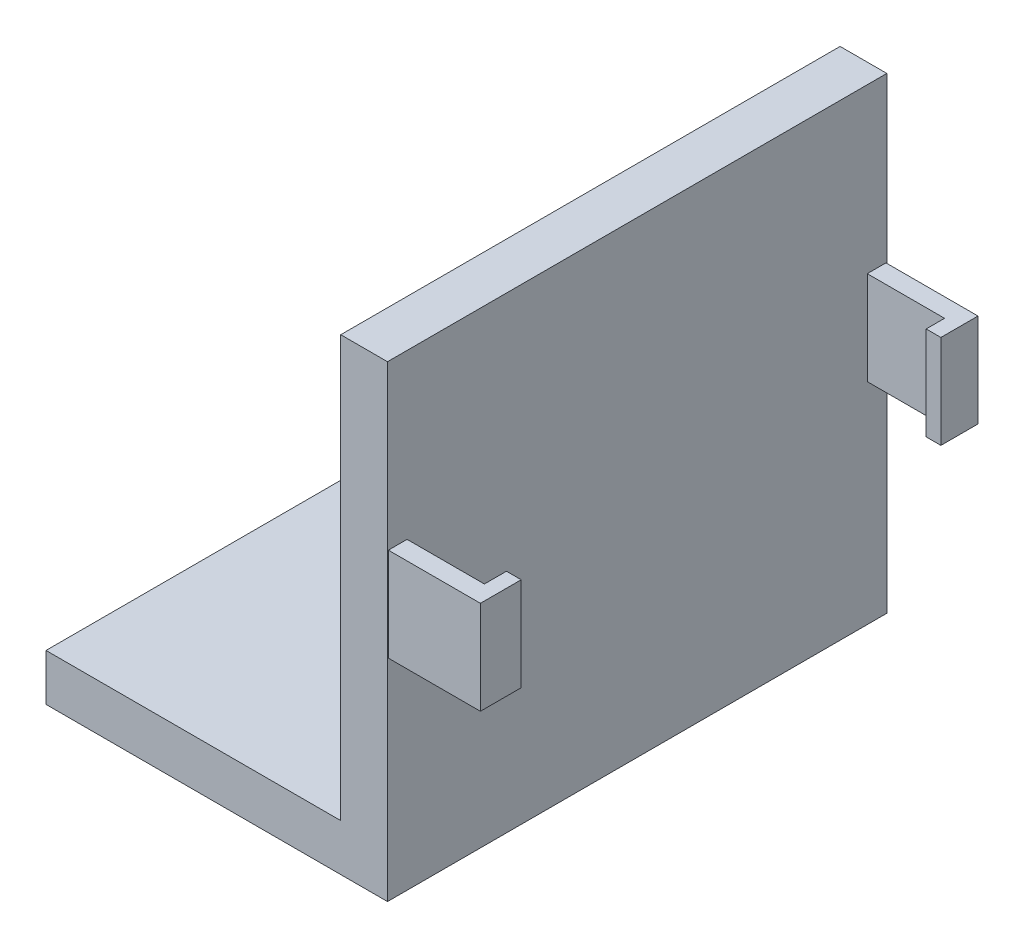
ISO-10303-21;
HEADER;
FILE_DESCRIPTION(('STEP AP214'),'2;1');
FILE_NAME('part.step','',(''),(''),'','','');
FILE_SCHEMA(('AUTOMOTIVE_DESIGN { 1 0 10303 214 1 1 1 1 }'));
ENDSEC;
DATA;
#1=APPLICATION_CONTEXT('core data for automotive mechanical design processes');
#2=APPLICATION_PROTOCOL_DEFINITION('international standard','automotive_design',2000,#1);
#3=PRODUCT_CONTEXT('',#1,'mechanical');
#4=PRODUCT('Part','Part','',(#3));
#5=PRODUCT_RELATED_PRODUCT_CATEGORY('part','',(#4));
#6=PRODUCT_DEFINITION_FORMATION('','',#4);
#7=PRODUCT_DEFINITION_CONTEXT('part definition',#1,'design');
#8=PRODUCT_DEFINITION('design','',#6,#7);
#9=PRODUCT_DEFINITION_SHAPE('','',#8);
#10=(LENGTH_UNIT() NAMED_UNIT(*) SI_UNIT(.MILLI.,.METRE.));
#11=(NAMED_UNIT(*) PLANE_ANGLE_UNIT() SI_UNIT($,.RADIAN.));
#12=(NAMED_UNIT(*) SI_UNIT($,.STERADIAN.) SOLID_ANGLE_UNIT());
#13=UNCERTAINTY_MEASURE_WITH_UNIT(LENGTH_MEASURE(1.E-05),#10,'distance_accuracy_value','');
#14=(GEOMETRIC_REPRESENTATION_CONTEXT(3) GLOBAL_UNCERTAINTY_ASSIGNED_CONTEXT((#13)) GLOBAL_UNIT_ASSIGNED_CONTEXT((#10,
#11,#12)) REPRESENTATION_CONTEXT('',''));
#15=CARTESIAN_POINT('',(0.,0.,0.));
#16=DIRECTION('',(0.,0.,1.));
#17=DIRECTION('',(1.,0.,0.));
#18=AXIS2_PLACEMENT_3D('',#15,#16,#17);
#19=CARTESIAN_POINT('',(0.,6.35,0.));
#20=DIRECTION('',(0.,1.,0.));
#21=DIRECTION('',(0.,0.,1.));
#22=AXIS2_PLACEMENT_3D('',#19,#20,#21);
#23=PLANE('',#22);
#24=DIRECTION('',(0.,0.,1.));
#25=VECTOR('',#24,1.);
#26=CARTESIAN_POINT('',(-25.4,6.35,-33.909));
#27=LINE('',#26,#25);
#28=CARTESIAN_POINT('',(-25.4,6.35,-33.909));
#29=VERTEX_POINT('',#28);
#30=CARTESIAN_POINT('',(-25.4,6.35,33.909));
#31=VERTEX_POINT('',#30);
#32=EDGE_CURVE('E204',#29,#31,#27,.T.);
#33=ORIENTED_EDGE('',*,*,#32,.T.);
#34=DIRECTION('',(1.,0.,0.));
#35=VECTOR('',#34,1.);
#36=CARTESIAN_POINT('',(20.9799264055813,6.35,33.909));
#37=LINE('',#36,#35);
#38=CARTESIAN_POINT('',(14.6299264055813,6.35,33.909));
#39=VERTEX_POINT('',#38);
#40=EDGE_CURVE('E177',#31,#39,#37,.T.);
#41=ORIENTED_EDGE('',*,*,#40,.T.);
#42=DIRECTION('',(0.,0.,1.));
#43=VECTOR('',#42,1.);
#44=CARTESIAN_POINT('',(14.6299264055813,6.35,-33.909));
#45=LINE('',#44,#43);
#46=CARTESIAN_POINT('',(14.6299264055813,6.35,-33.909));
#47=VERTEX_POINT('',#46);
#48=EDGE_CURVE('E331',#47,#39,#45,.T.);
#49=ORIENTED_EDGE('',*,*,#48,.F.);
#50=DIRECTION('',(-1.,0.,0.));
#51=VECTOR('',#50,1.);
#52=CARTESIAN_POINT('',(20.9799264055813,6.35,-33.909));
#53=LINE('',#52,#51);
#54=EDGE_CURVE('E200',#47,#29,#53,.T.);
#55=ORIENTED_EDGE('',*,*,#54,.T.);
#56=EDGE_LOOP('',(#33,#41,#49,#55));
#57=FACE_BOUND('',#56,.T.);
#58=ADVANCED_FACE('F40',(#57),#23,.T.);
#59=CARTESIAN_POINT('',(33.4799264875813,41.275,-31.25));
#60=DIRECTION('',(0.,0.,-1.));
#61=DIRECTION('',(-1.,0.,0.));
#62=AXIS2_PLACEMENT_3D('',#59,#60,#61);
#63=PLANE('',#62);
#64=DIRECTION('',(0.,-1.,0.));
#65=VECTOR('',#64,1.);
#66=CARTESIAN_POINT('',(31.4799264875813,41.275,-31.25));
#67=LINE('',#66,#65);
#68=CARTESIAN_POINT('',(31.4799264875813,41.275,-31.25));
#69=VERTEX_POINT('',#68);
#70=CARTESIAN_POINT('',(31.4799264875813,28.575,-31.25));
#71=VERTEX_POINT('',#70);
#72=EDGE_CURVE('E182',#69,#71,#67,.T.);
#73=ORIENTED_EDGE('',*,*,#72,.F.);
#74=DIRECTION('',(-1.,0.,0.));
#75=VECTOR('',#74,1.);
#76=CARTESIAN_POINT('',(33.4799264875813,41.275,-31.25));
#77=LINE('',#76,#75);
#78=CARTESIAN_POINT('',(20.9799264055813,41.275,-31.25));
#79=VERTEX_POINT('',#78);
#80=EDGE_CURVE('E303',#69,#79,#77,.T.);
#81=ORIENTED_EDGE('',*,*,#80,.T.);
#82=DIRECTION('',(0.,-1.,0.));
#83=VECTOR('',#82,1.);
#84=CARTESIAN_POINT('',(20.9799264055813,41.275,-31.25));
#85=LINE('',#84,#83);
#86=CARTESIAN_POINT('',(20.9799264055813,28.575,-31.25));
#87=VERTEX_POINT('',#86);
#88=EDGE_CURVE('E292',#79,#87,#85,.T.);
#89=ORIENTED_EDGE('',*,*,#88,.T.);
#90=DIRECTION('',(-1.,0.,0.));
#91=VECTOR('',#90,1.);
#92=CARTESIAN_POINT('',(33.4799264875813,28.575,-31.25));
#93=LINE('',#92,#91);
#94=EDGE_CURVE('E328',#71,#87,#93,.T.);
#95=ORIENTED_EDGE('',*,*,#94,.F.);
#96=EDGE_LOOP('',(#73,#81,#89,#95));
#97=FACE_BOUND('',#96,.T.);
#98=ADVANCED_FACE('F382',(#97),#63,.F.);
#99=CARTESIAN_POINT('',(33.4799264875813,41.275,31.25));
#100=DIRECTION('',(0.,0.,1.));
#101=DIRECTION('',(1.,0.,0.));
#102=AXIS2_PLACEMENT_3D('',#99,#100,#101);
#103=PLANE('',#102);
#104=DIRECTION('',(0.,1.,0.));
#105=VECTOR('',#104,1.);
#106=CARTESIAN_POINT('',(31.4799264875813,41.275,31.25));
#107=LINE('',#106,#105);
#108=CARTESIAN_POINT('',(31.4799264875813,28.575,31.25));
#109=VERTEX_POINT('',#108);
#110=CARTESIAN_POINT('',(31.4799264875813,41.275,31.25));
#111=VERTEX_POINT('',#110);
#112=EDGE_CURVE('E232',#109,#111,#107,.T.);
#113=ORIENTED_EDGE('',*,*,#112,.F.);
#114=DIRECTION('',(-1.,0.,0.));
#115=VECTOR('',#114,1.);
#116=CARTESIAN_POINT('',(33.4799264875813,28.575,31.25));
#117=LINE('',#116,#115);
#118=CARTESIAN_POINT('',(20.9799264055813,28.575,31.25));
#119=VERTEX_POINT('',#118);
#120=EDGE_CURVE('E266',#109,#119,#117,.T.);
#121=ORIENTED_EDGE('',*,*,#120,.T.);
#122=DIRECTION('',(0.,1.,0.));
#123=VECTOR('',#122,1.);
#124=CARTESIAN_POINT('',(20.9799264055813,41.275,31.25));
#125=LINE('',#124,#123);
#126=CARTESIAN_POINT('',(20.9799264055813,41.275,31.25));
#127=VERTEX_POINT('',#126);
#128=EDGE_CURVE('E255',#119,#127,#125,.T.);
#129=ORIENTED_EDGE('',*,*,#128,.T.);
#130=DIRECTION('',(-1.,0.,0.));
#131=VECTOR('',#130,1.);
#132=CARTESIAN_POINT('',(33.4799264875813,41.275,31.25));
#133=LINE('',#132,#131);
#134=EDGE_CURVE('E64',#111,#127,#133,.T.);
#135=ORIENTED_EDGE('',*,*,#134,.F.);
#136=EDGE_LOOP('',(#113,#121,#129,#135));
#137=FACE_BOUND('',#136,.T.);
#138=ADVANCED_FACE('F386',(#137),#103,.F.);
#139=CARTESIAN_POINT('',(20.9799264055813,63.5,-33.909));
#140=DIRECTION('',(-1.,0.,0.));
#141=DIRECTION('',(0.,0.,1.));
#142=AXIS2_PLACEMENT_3D('',#139,#140,#141);
#143=PLANE('',#142);
#144=ORIENTED_EDGE('',*,*,#88,.F.);
#145=DIRECTION('',(0.,0.,1.));
#146=VECTOR('',#145,1.);
#147=CARTESIAN_POINT('',(20.9799264055813,41.275,-31.25));
#148=LINE('',#147,#146);
#149=CARTESIAN_POINT('',(20.9799264055813,41.275,-33.79));
#150=VERTEX_POINT('',#149);
#151=EDGE_CURVE('E297',#150,#79,#148,.T.);
#152=ORIENTED_EDGE('',*,*,#151,.F.);
#153=DIRECTION('',(0.,1.,0.));
#154=VECTOR('',#153,1.);
#155=CARTESIAN_POINT('',(20.9799264055813,41.275,-33.79));
#156=LINE('',#155,#154);
#157=CARTESIAN_POINT('',(20.9799264055813,28.575,-33.79));
#158=VERTEX_POINT('',#157);
#159=EDGE_CURVE('E311',#158,#150,#156,.T.);
#160=ORIENTED_EDGE('',*,*,#159,.F.);
#161=DIRECTION('',(0.,0.,-1.));
#162=VECTOR('',#161,1.);
#163=CARTESIAN_POINT('',(20.9799264055813,28.575,-31.25));
#164=LINE('',#163,#162);
#165=EDGE_CURVE('E307',#87,#158,#164,.T.);
#166=ORIENTED_EDGE('',*,*,#165,.F.);
#167=EDGE_LOOP('',(#144,#152,#160,#166));
#168=FACE_BOUND('',#167,.T.);
#169=DIRECTION('',(0.,-1.,0.));
#170=VECTOR('',#169,1.);
#171=CARTESIAN_POINT('',(20.9799264055813,63.5,33.909));
#172=LINE('',#171,#170);
#173=CARTESIAN_POINT('',(20.9799264055813,63.5,33.909));
#174=VERTEX_POINT('',#173);
#175=CARTESIAN_POINT('',(20.9799264055813,0.,33.909));
#176=VERTEX_POINT('',#175);
#177=EDGE_CURVE('E49',#174,#176,#172,.T.);
#178=ORIENTED_EDGE('',*,*,#177,.T.);
#179=DIRECTION('',(0.,0.,-1.));
#180=VECTOR('',#179,1.);
#181=CARTESIAN_POINT('',(20.9799264055813,0.,-33.909));
#182=LINE('',#181,#180);
#183=CARTESIAN_POINT('',(20.9799264055813,0.,-33.909));
#184=VERTEX_POINT('',#183);
#185=EDGE_CURVE('E193',#176,#184,#182,.T.);
#186=ORIENTED_EDGE('',*,*,#185,.T.);
#187=DIRECTION('',(0.,-1.,0.));
#188=VECTOR('',#187,1.);
#189=CARTESIAN_POINT('',(20.9799264055813,63.5,-33.909));
#190=LINE('',#189,#188);
#191=CARTESIAN_POINT('',(20.9799264055813,63.5,-33.909));
#192=VERTEX_POINT('',#191);
#193=EDGE_CURVE('E56',#192,#184,#190,.T.);
#194=ORIENTED_EDGE('',*,*,#193,.F.);
#195=DIRECTION('',(0.,0.,-1.));
#196=VECTOR('',#195,1.);
#197=CARTESIAN_POINT('',(20.9799264055813,63.5,-33.909));
#198=LINE('',#197,#196);
#199=EDGE_CURVE('E339',#174,#192,#198,.T.);
#200=ORIENTED_EDGE('',*,*,#199,.F.);
#201=EDGE_LOOP('',(#178,#186,#194,#200));
#202=FACE_BOUND('',#201,.T.);
#203=ORIENTED_EDGE('',*,*,#128,.F.);
#204=DIRECTION('',(0.,0.,-1.));
#205=VECTOR('',#204,1.);
#206=CARTESIAN_POINT('',(20.9799264055813,28.575,31.25));
#207=LINE('',#206,#205);
#208=CARTESIAN_POINT('',(20.9799264055813,28.575,33.79));
#209=VERTEX_POINT('',#208);
#210=EDGE_CURVE('E260',#209,#119,#207,.T.);
#211=ORIENTED_EDGE('',*,*,#210,.F.);
#212=DIRECTION('',(0.,-1.,0.));
#213=VECTOR('',#212,1.);
#214=CARTESIAN_POINT('',(20.9799264055813,41.275,33.79));
#215=LINE('',#214,#213);
#216=CARTESIAN_POINT('',(20.9799264055813,41.275,33.79));
#217=VERTEX_POINT('',#216);
#218=EDGE_CURVE('E273',#217,#209,#215,.T.);
#219=ORIENTED_EDGE('',*,*,#218,.F.);
#220=DIRECTION('',(0.,0.,1.));
#221=VECTOR('',#220,1.);
#222=CARTESIAN_POINT('',(20.9799264055813,41.275,31.25));
#223=LINE('',#222,#221);
#224=EDGE_CURVE('E270',#127,#217,#223,.T.);
#225=ORIENTED_EDGE('',*,*,#224,.F.);
#226=EDGE_LOOP('',(#203,#211,#219,#225));
#227=FACE_BOUND('',#226,.T.);
#228=ADVANCED_FACE('F356',(#168,#202,#227),#143,.F.);
#229=CARTESIAN_POINT('',(14.6299264055813,63.5,-33.909));
#230=DIRECTION('',(1.,0.,0.));
#231=DIRECTION('',(0.,0.,-1.));
#232=AXIS2_PLACEMENT_3D('',#229,#230,#231);
#233=PLANE('',#232);
#234=ORIENTED_EDGE('',*,*,#48,.T.);
#235=DIRECTION('',(0.,-1.,0.));
#236=VECTOR('',#235,1.);
#237=CARTESIAN_POINT('',(14.6299264055813,63.5,33.909));
#238=LINE('',#237,#236);
#239=CARTESIAN_POINT('',(14.6299264055813,63.5,33.909));
#240=VERTEX_POINT('',#239);
#241=EDGE_CURVE('E12',#240,#39,#238,.T.);
#242=ORIENTED_EDGE('',*,*,#241,.F.);
#243=DIRECTION('',(0.,0.,1.));
#244=VECTOR('',#243,1.);
#245=CARTESIAN_POINT('',(14.6299264055813,63.5,-33.909));
#246=LINE('',#245,#244);
#247=CARTESIAN_POINT('',(14.6299264055813,63.5,-33.909));
#248=VERTEX_POINT('',#247);
#249=EDGE_CURVE('E332',#248,#240,#246,.T.);
#250=ORIENTED_EDGE('',*,*,#249,.F.);
#251=DIRECTION('',(0.,-1.,0.));
#252=VECTOR('',#251,1.);
#253=CARTESIAN_POINT('',(14.6299264055813,63.5,-33.909));
#254=LINE('',#253,#252);
#255=EDGE_CURVE('E345',#248,#47,#254,.T.);
#256=ORIENTED_EDGE('',*,*,#255,.T.);
#257=EDGE_LOOP('',(#234,#242,#250,#256));
#258=FACE_BOUND('',#257,.T.);
#259=ADVANCED_FACE('F364',(#258),#233,.F.);
#260=CARTESIAN_POINT('',(14.6299264055813,63.5,33.909));
#261=DIRECTION('',(0.,0.,-1.));
#262=DIRECTION('',(-1.,0.,0.));
#263=AXIS2_PLACEMENT_3D('',#260,#261,#262);
#264=PLANE('',#263);
#265=ORIENTED_EDGE('',*,*,#241,.T.);
#266=ORIENTED_EDGE('',*,*,#40,.F.);
#267=DIRECTION('',(0.,1.,0.));
#268=VECTOR('',#267,1.);
#269=CARTESIAN_POINT('',(-25.4,0.,33.909));
#270=LINE('',#269,#268);
#271=CARTESIAN_POINT('',(-25.4,0.,33.909));
#272=VERTEX_POINT('',#271);
#273=EDGE_CURVE('E170',#272,#31,#270,.T.);
#274=ORIENTED_EDGE('',*,*,#273,.F.);
#275=DIRECTION('',(1.,0.,0.));
#276=VECTOR('',#275,1.);
#277=CARTESIAN_POINT('',(20.9799264055813,0.,33.909));
#278=LINE('',#277,#276);
#279=EDGE_CURVE('E175',#272,#176,#278,.T.);
#280=ORIENTED_EDGE('',*,*,#279,.T.);
#281=ORIENTED_EDGE('',*,*,#177,.F.);
#282=DIRECTION('',(1.,0.,0.));
#283=VECTOR('',#282,1.);
#284=CARTESIAN_POINT('',(14.6299264055813,63.5,33.909));
#285=LINE('',#284,#283);
#286=EDGE_CURVE('E336',#240,#174,#285,.T.);
#287=ORIENTED_EDGE('',*,*,#286,.F.);
#288=EDGE_LOOP('',(#265,#266,#274,#280,#281,#287));
#289=FACE_BOUND('',#288,.T.);
#290=ADVANCED_FACE('F172',(#289),#264,.F.);
#291=CARTESIAN_POINT('',(14.6299264055813,63.5,-33.909));
#292=DIRECTION('',(0.,0.,1.));
#293=DIRECTION('',(1.,0.,0.));
#294=AXIS2_PLACEMENT_3D('',#291,#292,#293);
#295=PLANE('',#294);
#296=ORIENTED_EDGE('',*,*,#193,.T.);
#297=DIRECTION('',(-1.,0.,0.));
#298=VECTOR('',#297,1.);
#299=CARTESIAN_POINT('',(20.9799264055813,0.,-33.909));
#300=LINE('',#299,#298);
#301=CARTESIAN_POINT('',(-25.4,0.,-33.909));
#302=VERTEX_POINT('',#301);
#303=EDGE_CURVE('E191',#184,#302,#300,.T.);
#304=ORIENTED_EDGE('',*,*,#303,.T.);
#305=DIRECTION('',(0.,1.,0.));
#306=VECTOR('',#305,1.);
#307=CARTESIAN_POINT('',(-25.4,0.,-33.909));
#308=LINE('',#307,#306);
#309=EDGE_CURVE('E183',#302,#29,#308,.T.);
#310=ORIENTED_EDGE('',*,*,#309,.T.);
#311=ORIENTED_EDGE('',*,*,#54,.F.);
#312=ORIENTED_EDGE('',*,*,#255,.F.);
#313=DIRECTION('',(-1.,0.,0.));
#314=VECTOR('',#313,1.);
#315=CARTESIAN_POINT('',(14.6299264055813,63.5,-33.909));
#316=LINE('',#315,#314);
#317=EDGE_CURVE('E342',#192,#248,#316,.T.);
#318=ORIENTED_EDGE('',*,*,#317,.F.);
#319=EDGE_LOOP('',(#296,#304,#310,#311,#312,#318));
#320=FACE_BOUND('',#319,.T.);
#321=ADVANCED_FACE('F367',(#320),#295,.F.);
#322=CARTESIAN_POINT('',(0.,63.5,0.));
#323=DIRECTION('',(0.,1.,0.));
#324=DIRECTION('',(0.,0.,1.));
#325=AXIS2_PLACEMENT_3D('',#322,#323,#324);
#326=PLANE('',#325);
#327=ORIENTED_EDGE('',*,*,#249,.T.);
#328=ORIENTED_EDGE('',*,*,#286,.T.);
#329=ORIENTED_EDGE('',*,*,#199,.T.);
#330=ORIENTED_EDGE('',*,*,#317,.T.);
#331=EDGE_LOOP('',(#327,#328,#329,#330));
#332=FACE_BOUND('',#331,.T.);
#333=ADVANCED_FACE('F361',(#332),#326,.T.);
#334=CARTESIAN_POINT('',(33.4799264875813,28.575,-31.25));
#335=DIRECTION('',(0.,1.,0.));
#336=DIRECTION('',(0.,0.,1.));
#337=AXIS2_PLACEMENT_3D('',#334,#335,#336);
#338=PLANE('',#337);
#339=ORIENTED_EDGE('',*,*,#165,.T.);
#340=DIRECTION('',(-1.,0.,0.));
#341=VECTOR('',#340,1.);
#342=CARTESIAN_POINT('',(33.4799264875813,28.575,-33.79));
#343=LINE('',#342,#341);
#344=CARTESIAN_POINT('',(33.4799264875813,28.575,-33.79));
#345=VERTEX_POINT('',#344);
#346=EDGE_CURVE('E324',#345,#158,#343,.T.);
#347=ORIENTED_EDGE('',*,*,#346,.F.);
#348=DIRECTION('',(0.,0.,-1.));
#349=VECTOR('',#348,1.);
#350=CARTESIAN_POINT('',(33.4799264875813,28.575,-31.25));
#351=LINE('',#350,#349);
#352=CARTESIAN_POINT('',(33.4799264875813,28.575,-28.75));
#353=VERTEX_POINT('',#352);
#354=EDGE_CURVE('E293',#353,#345,#351,.T.);
#355=ORIENTED_EDGE('',*,*,#354,.F.);
#356=DIRECTION('',(1.,0.,0.));
#357=VECTOR('',#356,1.);
#358=CARTESIAN_POINT('',(33.4799264875813,28.575,-28.75));
#359=LINE('',#358,#357);
#360=CARTESIAN_POINT('',(31.4799264875813,28.575,-28.75));
#361=VERTEX_POINT('',#360);
#362=EDGE_CURVE('E219',#361,#353,#359,.T.);
#363=ORIENTED_EDGE('',*,*,#362,.F.);
#364=DIRECTION('',(0.,0.,-1.));
#365=VECTOR('',#364,1.);
#366=CARTESIAN_POINT('',(31.4799264875813,28.575,-28.75));
#367=LINE('',#366,#365);
#368=EDGE_CURVE('E223',#361,#71,#367,.T.);
#369=ORIENTED_EDGE('',*,*,#368,.T.);
#370=ORIENTED_EDGE('',*,*,#94,.T.);
#371=EDGE_LOOP('',(#339,#347,#355,#363,#369,#370));
#372=FACE_BOUND('',#371,.T.);
#373=ADVANCED_FACE('F377',(#372),#338,.F.);
#374=CARTESIAN_POINT('',(33.4799264875813,41.275,-33.79));
#375=DIRECTION('',(0.,0.,1.));
#376=DIRECTION('',(1.,0.,0.));
#377=AXIS2_PLACEMENT_3D('',#374,#375,#376);
#378=PLANE('',#377);
#379=ORIENTED_EDGE('',*,*,#159,.T.);
#380=DIRECTION('',(-1.,0.,0.));
#381=VECTOR('',#380,1.);
#382=CARTESIAN_POINT('',(33.4799264875813,41.275,-33.79));
#383=LINE('',#382,#381);
#384=CARTESIAN_POINT('',(33.4799264875813,41.275,-33.79));
#385=VERTEX_POINT('',#384);
#386=EDGE_CURVE('E320',#385,#150,#383,.T.);
#387=ORIENTED_EDGE('',*,*,#386,.F.);
#388=DIRECTION('',(0.,1.,0.));
#389=VECTOR('',#388,1.);
#390=CARTESIAN_POINT('',(33.4799264875813,41.275,-33.79));
#391=LINE('',#390,#389);
#392=EDGE_CURVE('E296',#345,#385,#391,.T.);
#393=ORIENTED_EDGE('',*,*,#392,.F.);
#394=ORIENTED_EDGE('',*,*,#346,.T.);
#395=EDGE_LOOP('',(#379,#387,#393,#394));
#396=FACE_BOUND('',#395,.T.);
#397=ADVANCED_FACE('F410',(#396),#378,.F.);
#398=CARTESIAN_POINT('',(33.4799264875813,41.275,-31.25));
#399=DIRECTION('',(0.,-1.,0.));
#400=DIRECTION('',(0.,0.,-1.));
#401=AXIS2_PLACEMENT_3D('',#398,#399,#400);
#402=PLANE('',#401);
#403=ORIENTED_EDGE('',*,*,#151,.T.);
#404=ORIENTED_EDGE('',*,*,#80,.F.);
#405=DIRECTION('',(0.,0.,-1.));
#406=VECTOR('',#405,1.);
#407=CARTESIAN_POINT('',(31.4799264875813,41.275,-28.75));
#408=LINE('',#407,#406);
#409=CARTESIAN_POINT('',(31.4799264875813,41.275,-28.75));
#410=VERTEX_POINT('',#409);
#411=EDGE_CURVE('E229',#410,#69,#408,.T.);
#412=ORIENTED_EDGE('',*,*,#411,.F.);
#413=DIRECTION('',(-1.,0.,0.));
#414=VECTOR('',#413,1.);
#415=CARTESIAN_POINT('',(33.4799264875813,41.275,-28.75));
#416=LINE('',#415,#414);
#417=CARTESIAN_POINT('',(33.4799264875813,41.275,-28.75));
#418=VERTEX_POINT('',#417);
#419=EDGE_CURVE('E213',#418,#410,#416,.T.);
#420=ORIENTED_EDGE('',*,*,#419,.F.);
#421=DIRECTION('',(0.,0.,1.));
#422=VECTOR('',#421,1.);
#423=CARTESIAN_POINT('',(33.4799264875813,41.275,-31.25));
#424=LINE('',#423,#422);
#425=EDGE_CURVE('E300',#385,#418,#424,.T.);
#426=ORIENTED_EDGE('',*,*,#425,.F.);
#427=ORIENTED_EDGE('',*,*,#386,.T.);
#428=EDGE_LOOP('',(#403,#404,#412,#420,#426,#427));
#429=FACE_BOUND('',#428,.T.);
#430=ADVANCED_FACE('F403',(#429),#402,.F.);
#431=CARTESIAN_POINT('',(33.4799264875813,0.,0.));
#432=DIRECTION('',(1.,0.,0.));
#433=DIRECTION('',(0.,0.,-1.));
#434=AXIS2_PLACEMENT_3D('',#431,#432,#433);
#435=PLANE('',#434);
#436=ORIENTED_EDGE('',*,*,#425,.T.);
#437=DIRECTION('',(0.,1.,0.));
#438=VECTOR('',#437,1.);
#439=CARTESIAN_POINT('',(33.4799264875813,41.275,-28.75));
#440=LINE('',#439,#438);
#441=EDGE_CURVE('E209',#353,#418,#440,.T.);
#442=ORIENTED_EDGE('',*,*,#441,.F.);
#443=ORIENTED_EDGE('',*,*,#354,.T.);
#444=ORIENTED_EDGE('',*,*,#392,.T.);
#445=EDGE_LOOP('',(#436,#442,#443,#444));
#446=FACE_BOUND('',#445,.T.);
#447=ADVANCED_FACE('F423',(#446),#435,.T.);
#448=CARTESIAN_POINT('',(33.4799264875813,41.275,31.25));
#449=DIRECTION('',(0.,-1.,0.));
#450=DIRECTION('',(0.,0.,-1.));
#451=AXIS2_PLACEMENT_3D('',#448,#449,#450);
#452=PLANE('',#451);
#453=ORIENTED_EDGE('',*,*,#224,.T.);
#454=DIRECTION('',(-1.,0.,0.));
#455=VECTOR('',#454,1.);
#456=CARTESIAN_POINT('',(33.4799264875813,41.275,33.79));
#457=LINE('',#456,#455);
#458=CARTESIAN_POINT('',(33.4799264875813,41.275,33.79));
#459=VERTEX_POINT('',#458);
#460=EDGE_CURVE('E286',#459,#217,#457,.T.);
#461=ORIENTED_EDGE('',*,*,#460,.F.);
#462=DIRECTION('',(0.,0.,1.));
#463=VECTOR('',#462,1.);
#464=CARTESIAN_POINT('',(33.4799264875813,41.275,31.25));
#465=LINE('',#464,#463);
#466=CARTESIAN_POINT('',(33.4799264875813,41.275,28.25));
#467=VERTEX_POINT('',#466);
#468=EDGE_CURVE('E256',#467,#459,#465,.T.);
#469=ORIENTED_EDGE('',*,*,#468,.F.);
#470=DIRECTION('',(1.,0.,0.));
#471=VECTOR('',#470,1.);
#472=CARTESIAN_POINT('',(33.4799264875813,41.275,28.25));
#473=LINE('',#472,#471);
#474=CARTESIAN_POINT('',(31.4799264875813,41.275,28.25));
#475=VERTEX_POINT('',#474);
#476=EDGE_CURVE('E243',#475,#467,#473,.T.);
#477=ORIENTED_EDGE('',*,*,#476,.F.);
#478=DIRECTION('',(0.,0.,1.));
#479=VECTOR('',#478,1.);
#480=CARTESIAN_POINT('',(31.4799264875813,41.275,28.25));
#481=LINE('',#480,#479);
#482=EDGE_CURVE('E247',#475,#111,#481,.T.);
#483=ORIENTED_EDGE('',*,*,#482,.T.);
#484=ORIENTED_EDGE('',*,*,#134,.T.);
#485=EDGE_LOOP('',(#453,#461,#469,#477,#483,#484));
#486=FACE_BOUND('',#485,.T.);
#487=ADVANCED_FACE('F425',(#486),#452,.F.);
#488=CARTESIAN_POINT('',(33.4799264875813,41.275,33.79));
#489=DIRECTION('',(0.,0.,-1.));
#490=DIRECTION('',(-1.,0.,0.));
#491=AXIS2_PLACEMENT_3D('',#488,#489,#490);
#492=PLANE('',#491);
#493=ORIENTED_EDGE('',*,*,#218,.T.);
#494=DIRECTION('',(-1.,0.,0.));
#495=VECTOR('',#494,1.);
#496=CARTESIAN_POINT('',(33.4799264875813,28.575,33.79));
#497=LINE('',#496,#495);
#498=CARTESIAN_POINT('',(33.4799264875813,28.575,33.79));
#499=VERTEX_POINT('',#498);
#500=EDGE_CURVE('E282',#499,#209,#497,.T.);
#501=ORIENTED_EDGE('',*,*,#500,.F.);
#502=DIRECTION('',(0.,-1.,0.));
#503=VECTOR('',#502,1.);
#504=CARTESIAN_POINT('',(33.4799264875813,41.275,33.79));
#505=LINE('',#504,#503);
#506=EDGE_CURVE('E259',#459,#499,#505,.T.);
#507=ORIENTED_EDGE('',*,*,#506,.F.);
#508=ORIENTED_EDGE('',*,*,#460,.T.);
#509=EDGE_LOOP('',(#493,#501,#507,#508));
#510=FACE_BOUND('',#509,.T.);
#511=ADVANCED_FACE('F431',(#510),#492,.F.);
#512=CARTESIAN_POINT('',(33.4799264875813,28.575,31.25));
#513=DIRECTION('',(0.,1.,0.));
#514=DIRECTION('',(0.,0.,1.));
#515=AXIS2_PLACEMENT_3D('',#512,#513,#514);
#516=PLANE('',#515);
#517=ORIENTED_EDGE('',*,*,#210,.T.);
#518=ORIENTED_EDGE('',*,*,#120,.F.);
#519=DIRECTION('',(0.,0.,1.));
#520=VECTOR('',#519,1.);
#521=CARTESIAN_POINT('',(31.4799264875813,28.575,28.25));
#522=LINE('',#521,#520);
#523=CARTESIAN_POINT('',(31.4799264875813,28.575,28.25));
#524=VERTEX_POINT('',#523);
#525=EDGE_CURVE('E252',#524,#109,#522,.T.);
#526=ORIENTED_EDGE('',*,*,#525,.F.);
#527=DIRECTION('',(-1.,0.,0.));
#528=VECTOR('',#527,1.);
#529=CARTESIAN_POINT('',(33.4799264875813,28.575,28.25));
#530=LINE('',#529,#528);
#531=CARTESIAN_POINT('',(33.4799264875813,28.575,28.25));
#532=VERTEX_POINT('',#531);
#533=EDGE_CURVE('E237',#532,#524,#530,.T.);
#534=ORIENTED_EDGE('',*,*,#533,.F.);
#535=DIRECTION('',(0.,0.,-1.));
#536=VECTOR('',#535,1.);
#537=CARTESIAN_POINT('',(33.4799264875813,28.575,31.25));
#538=LINE('',#537,#536);
#539=EDGE_CURVE('E263',#499,#532,#538,.T.);
#540=ORIENTED_EDGE('',*,*,#539,.F.);
#541=ORIENTED_EDGE('',*,*,#500,.T.);
#542=EDGE_LOOP('',(#517,#518,#526,#534,#540,#541));
#543=FACE_BOUND('',#542,.T.);
#544=ADVANCED_FACE('F532',(#543),#516,.F.);
#545=CARTESIAN_POINT('',(33.4799264875813,0.,0.));
#546=DIRECTION('',(-1.,0.,0.));
#547=DIRECTION('',(0.,0.,1.));
#548=AXIS2_PLACEMENT_3D('',#545,#546,#547);
#549=PLANE('',#548);
#550=ORIENTED_EDGE('',*,*,#539,.T.);
#551=DIRECTION('',(0.,-1.,0.));
#552=VECTOR('',#551,1.);
#553=CARTESIAN_POINT('',(33.4799264875813,41.275,28.25));
#554=LINE('',#553,#552);
#555=EDGE_CURVE('E233',#467,#532,#554,.T.);
#556=ORIENTED_EDGE('',*,*,#555,.F.);
#557=ORIENTED_EDGE('',*,*,#468,.T.);
#558=ORIENTED_EDGE('',*,*,#506,.T.);
#559=EDGE_LOOP('',(#550,#556,#557,#558));
#560=FACE_BOUND('',#559,.T.);
#561=ADVANCED_FACE('F528',(#560),#549,.F.);
#562=CARTESIAN_POINT('',(31.4799264875813,41.275,28.25));
#563=DIRECTION('',(1.,0.,0.));
#564=DIRECTION('',(0.,0.,-1.));
#565=AXIS2_PLACEMENT_3D('',#562,#563,#564);
#566=PLANE('',#565);
#567=ORIENTED_EDGE('',*,*,#112,.T.);
#568=ORIENTED_EDGE('',*,*,#482,.F.);
#569=DIRECTION('',(0.,1.,0.));
#570=VECTOR('',#569,1.);
#571=CARTESIAN_POINT('',(31.4799264875813,41.275,28.25));
#572=LINE('',#571,#570);
#573=EDGE_CURVE('E240',#524,#475,#572,.T.);
#574=ORIENTED_EDGE('',*,*,#573,.F.);
#575=ORIENTED_EDGE('',*,*,#525,.T.);
#576=EDGE_LOOP('',(#567,#568,#574,#575));
#577=FACE_BOUND('',#576,.T.);
#578=ADVANCED_FACE('F524',(#577),#566,.F.);
#579=CARTESIAN_POINT('',(0.,0.,28.25));
#580=DIRECTION('',(0.,0.,-1.));
#581=DIRECTION('',(-1.,0.,0.));
#582=AXIS2_PLACEMENT_3D('',#579,#580,#581);
#583=PLANE('',#582);
#584=ORIENTED_EDGE('',*,*,#555,.T.);
#585=ORIENTED_EDGE('',*,*,#533,.T.);
#586=ORIENTED_EDGE('',*,*,#573,.T.);
#587=ORIENTED_EDGE('',*,*,#476,.T.);
#588=EDGE_LOOP('',(#584,#585,#586,#587));
#589=FACE_BOUND('',#588,.T.);
#590=ADVANCED_FACE('F467',(#589),#583,.T.);
#591=CARTESIAN_POINT('',(31.4799264875813,41.275,-28.75));
#592=DIRECTION('',(1.,0.,0.));
#593=DIRECTION('',(0.,0.,-1.));
#594=AXIS2_PLACEMENT_3D('',#591,#592,#593);
#595=PLANE('',#594);
#596=ORIENTED_EDGE('',*,*,#72,.T.);
#597=ORIENTED_EDGE('',*,*,#368,.F.);
#598=DIRECTION('',(0.,-1.,0.));
#599=VECTOR('',#598,1.);
#600=CARTESIAN_POINT('',(31.4799264875813,41.275,-28.75));
#601=LINE('',#600,#599);
#602=EDGE_CURVE('E216',#410,#361,#601,.T.);
#603=ORIENTED_EDGE('',*,*,#602,.F.);
#604=ORIENTED_EDGE('',*,*,#411,.T.);
#605=EDGE_LOOP('',(#596,#597,#603,#604));
#606=FACE_BOUND('',#605,.T.);
#607=ADVANCED_FACE('F417',(#606),#595,.F.);
#608=CARTESIAN_POINT('',(0.,0.,-28.75));
#609=DIRECTION('',(0.,0.,-1.));
#610=DIRECTION('',(-1.,0.,0.));
#611=AXIS2_PLACEMENT_3D('',#608,#609,#610);
#612=PLANE('',#611);
#613=ORIENTED_EDGE('',*,*,#441,.T.);
#614=ORIENTED_EDGE('',*,*,#419,.T.);
#615=ORIENTED_EDGE('',*,*,#602,.T.);
#616=ORIENTED_EDGE('',*,*,#362,.T.);
#617=EDGE_LOOP('',(#613,#614,#615,#616));
#618=FACE_BOUND('',#617,.T.);
#619=ADVANCED_FACE('F421',(#618),#612,.F.);
#620=CARTESIAN_POINT('',(-25.4,0.,-33.909));
#621=DIRECTION('',(-1.,0.,0.));
#622=DIRECTION('',(0.,0.,1.));
#623=AXIS2_PLACEMENT_3D('',#620,#621,#622);
#624=PLANE('',#623);
#625=ORIENTED_EDGE('',*,*,#32,.F.);
#626=ORIENTED_EDGE('',*,*,#309,.F.);
#627=DIRECTION('',(0.,0.,1.));
#628=VECTOR('',#627,1.);
#629=CARTESIAN_POINT('',(-25.4,0.,-33.909));
#630=LINE('',#629,#628);
#631=EDGE_CURVE('E186',#302,#272,#630,.T.);
#632=ORIENTED_EDGE('',*,*,#631,.T.);
#633=ORIENTED_EDGE('',*,*,#273,.T.);
#634=EDGE_LOOP('',(#625,#626,#632,#633));
#635=FACE_BOUND('',#634,.T.);
#636=ADVANCED_FACE('F187',(#635),#624,.T.);
#637=CARTESIAN_POINT('',(0.,0.,0.));
#638=DIRECTION('',(0.,1.,0.));
#639=DIRECTION('',(0.,0.,1.));
#640=AXIS2_PLACEMENT_3D('',#637,#638,#639);
#641=PLANE('',#640);
#642=ORIENTED_EDGE('',*,*,#185,.F.);
#643=ORIENTED_EDGE('',*,*,#279,.F.);
#644=ORIENTED_EDGE('',*,*,#631,.F.);
#645=ORIENTED_EDGE('',*,*,#303,.F.);
#646=EDGE_LOOP('',(#642,#643,#644,#645));
#647=FACE_BOUND('',#646,.T.);
#648=ADVANCED_FACE('F42',(#647),#641,.F.);
#649=CLOSED_SHELL('',(#58,#98,#138,#228,#259,#290,#321,#333,#373,#397,#430,#447,#487,#511,#544,
#561,#578,#590,#607,#619,#636,#648));
#650=MANIFOLD_SOLID_BREP('B2',#649);
#651=ADVANCED_BREP_SHAPE_REPRESENTATION('',(#18,#650),#14);
#652=SHAPE_DEFINITION_REPRESENTATION(#9,#651);
ENDSEC;
END-ISO-10303-21;
